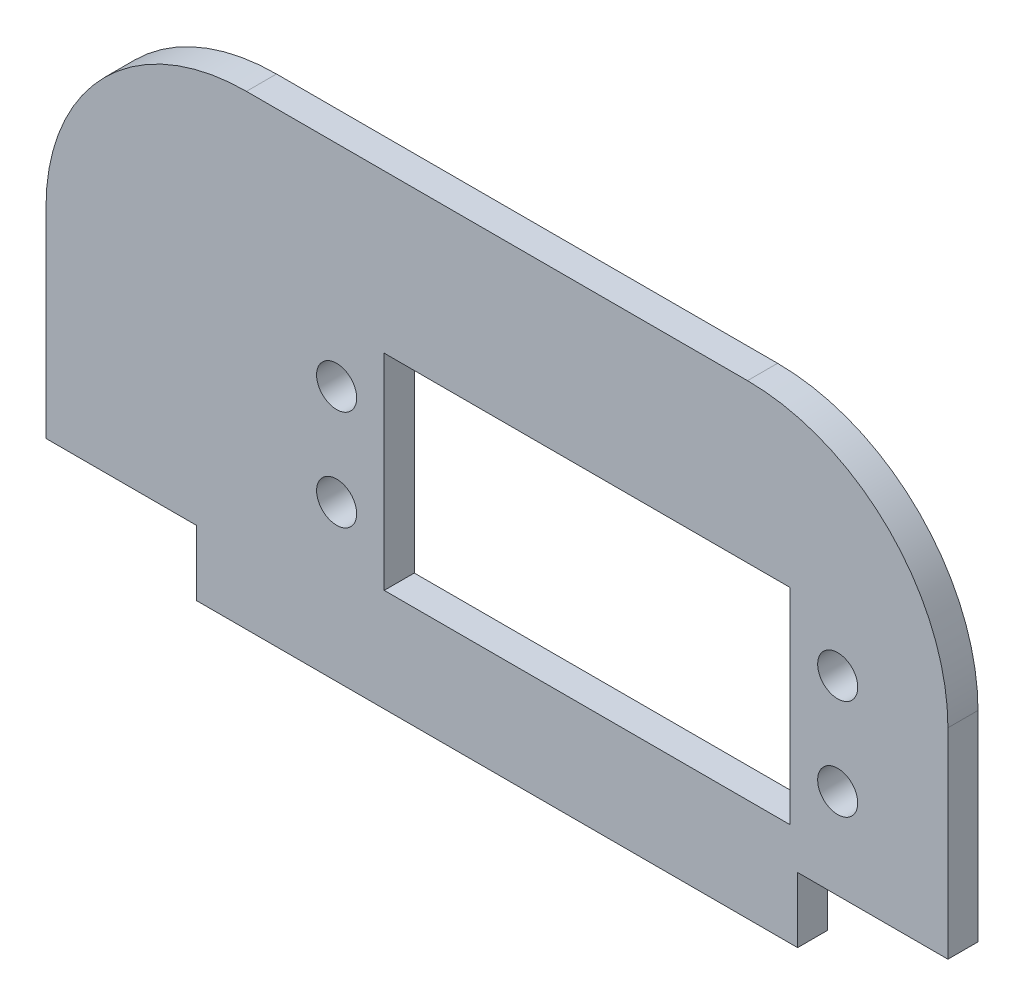
ISO-10303-21;
HEADER;
FILE_DESCRIPTION(('STEP AP214'),'2;1');
FILE_NAME('part.step','',(''),(''),'','','');
FILE_SCHEMA(('AUTOMOTIVE_DESIGN { 1 0 10303 214 1 1 1 1 }'));
ENDSEC;
DATA;
#1=APPLICATION_CONTEXT('core data for automotive mechanical design processes');
#2=APPLICATION_PROTOCOL_DEFINITION('international standard','automotive_design',2000,#1);
#3=PRODUCT_CONTEXT('',#1,'mechanical');
#4=PRODUCT('Part','Part','',(#3));
#5=PRODUCT_RELATED_PRODUCT_CATEGORY('part','',(#4));
#6=PRODUCT_DEFINITION_FORMATION('','',#4);
#7=PRODUCT_DEFINITION_CONTEXT('part definition',#1,'design');
#8=PRODUCT_DEFINITION('design','',#6,#7);
#9=PRODUCT_DEFINITION_SHAPE('','',#8);
#10=(LENGTH_UNIT() NAMED_UNIT(*) SI_UNIT(.MILLI.,.METRE.));
#11=(NAMED_UNIT(*) PLANE_ANGLE_UNIT() SI_UNIT($,.RADIAN.));
#12=(NAMED_UNIT(*) SI_UNIT($,.STERADIAN.) SOLID_ANGLE_UNIT());
#13=UNCERTAINTY_MEASURE_WITH_UNIT(LENGTH_MEASURE(1.E-05),#10,'distance_accuracy_value','');
#14=(GEOMETRIC_REPRESENTATION_CONTEXT(3) GLOBAL_UNCERTAINTY_ASSIGNED_CONTEXT((#13)) GLOBAL_UNIT_ASSIGNED_CONTEXT((#10,
#11,#12)) REPRESENTATION_CONTEXT('',''));
#15=CARTESIAN_POINT('',(0.,0.,0.));
#16=DIRECTION('',(0.,0.,1.));
#17=DIRECTION('',(1.,0.,0.));
#18=AXIS2_PLACEMENT_3D('',#15,#16,#17);
#19=CARTESIAN_POINT('',(45.,-20.,3.));
#20=DIRECTION('',(-1.,0.,0.));
#21=DIRECTION('',(0.,-1.,0.));
#22=AXIS2_PLACEMENT_3D('',#19,#20,#21);
#23=PLANE('',#22);
#24=DIRECTION('',(0.,1.,0.));
#25=VECTOR('',#24,1.);
#26=CARTESIAN_POINT('',(45.,-20.,0.));
#27=LINE('',#26,#25);
#28=CARTESIAN_POINT('',(45.,-20.,0.));
#29=VERTEX_POINT('',#28);
#30=CARTESIAN_POINT('',(45.,0.,0.));
#31=VERTEX_POINT('',#30);
#32=EDGE_CURVE('E159',#29,#31,#27,.T.);
#33=ORIENTED_EDGE('',*,*,#32,.T.);
#34=DIRECTION('',(0.,0.,-1.));
#35=VECTOR('',#34,1.);
#36=CARTESIAN_POINT('',(45.,0.,3.));
#37=LINE('',#36,#35);
#38=CARTESIAN_POINT('',(45.,0.,3.));
#39=VERTEX_POINT('',#38);
#40=EDGE_CURVE('E66',#31,#39,#37,.F.);
#41=ORIENTED_EDGE('',*,*,#40,.T.);
#42=DIRECTION('',(0.,1.,0.));
#43=VECTOR('',#42,1.);
#44=CARTESIAN_POINT('',(45.,-20.,3.));
#45=LINE('',#44,#43);
#46=CARTESIAN_POINT('',(45.,-20.,3.));
#47=VERTEX_POINT('',#46);
#48=EDGE_CURVE('E201',#47,#39,#45,.T.);
#49=ORIENTED_EDGE('',*,*,#48,.F.);
#50=DIRECTION('',(0.,0.,-1.));
#51=VECTOR('',#50,1.);
#52=CARTESIAN_POINT('',(45.,-20.,3.));
#53=LINE('',#52,#51);
#54=EDGE_CURVE('E226',#47,#29,#53,.T.);
#55=ORIENTED_EDGE('',*,*,#54,.T.);
#56=EDGE_LOOP('',(#33,#41,#49,#55));
#57=FACE_BOUND('',#56,.T.);
#58=ADVANCED_FACE('F42',(#57),#23,.F.);
#59=CARTESIAN_POINT('',(-45.,20.,3.));
#60=DIRECTION('',(0.,-1.,0.));
#61=DIRECTION('',(0.,0.,-1.));
#62=AXIS2_PLACEMENT_3D('',#59,#60,#61);
#63=PLANE('',#62);
#64=DIRECTION('',(-1.,0.,0.));
#65=VECTOR('',#64,1.);
#66=CARTESIAN_POINT('',(-45.,20.,3.));
#67=LINE('',#66,#65);
#68=CARTESIAN_POINT('',(25.,20.,3.));
#69=VERTEX_POINT('',#68);
#70=CARTESIAN_POINT('',(-25.,20.,3.));
#71=VERTEX_POINT('',#70);
#72=EDGE_CURVE('E204',#69,#71,#67,.T.);
#73=ORIENTED_EDGE('',*,*,#72,.F.);
#74=DIRECTION('',(0.,0.,-1.));
#75=VECTOR('',#74,1.);
#76=CARTESIAN_POINT('',(25.,20.,3.));
#77=LINE('',#76,#75);
#78=CARTESIAN_POINT('',(25.,20.,0.));
#79=VERTEX_POINT('',#78);
#80=EDGE_CURVE('E276',#69,#79,#77,.T.);
#81=ORIENTED_EDGE('',*,*,#80,.T.);
#82=DIRECTION('',(-1.,0.,0.));
#83=VECTOR('',#82,1.);
#84=CARTESIAN_POINT('',(-45.,20.,0.));
#85=LINE('',#84,#83);
#86=CARTESIAN_POINT('',(-25.,20.,0.));
#87=VERTEX_POINT('',#86);
#88=EDGE_CURVE('E229',#79,#87,#85,.T.);
#89=ORIENTED_EDGE('',*,*,#88,.T.);
#90=DIRECTION('',(0.,0.,-1.));
#91=VECTOR('',#90,1.);
#92=CARTESIAN_POINT('',(-25.,20.,3.));
#93=LINE('',#92,#91);
#94=EDGE_CURVE('E273',#87,#71,#93,.F.);
#95=ORIENTED_EDGE('',*,*,#94,.T.);
#96=EDGE_LOOP('',(#73,#81,#89,#95));
#97=FACE_BOUND('',#96,.T.);
#98=ADVANCED_FACE('F296',(#97),#63,.F.);
#99=CARTESIAN_POINT('',(-45.,-20.,3.));
#100=DIRECTION('',(1.,0.,0.));
#101=DIRECTION('',(0.,0.,-1.));
#102=AXIS2_PLACEMENT_3D('',#99,#100,#101);
#103=PLANE('',#102);
#104=DIRECTION('',(0.,-1.,0.));
#105=VECTOR('',#104,1.);
#106=CARTESIAN_POINT('',(-45.,-20.,3.));
#107=LINE('',#106,#105);
#108=CARTESIAN_POINT('',(-45.,0.,3.));
#109=VERTEX_POINT('',#108);
#110=CARTESIAN_POINT('',(-45.,-20.,3.));
#111=VERTEX_POINT('',#110);
#112=EDGE_CURVE('E208',#109,#111,#107,.T.);
#113=ORIENTED_EDGE('',*,*,#112,.F.);
#114=DIRECTION('',(0.,0.,-1.));
#115=VECTOR('',#114,1.);
#116=CARTESIAN_POINT('',(-45.,0.,3.));
#117=LINE('',#116,#115);
#118=CARTESIAN_POINT('',(-45.,0.,0.));
#119=VERTEX_POINT('',#118);
#120=EDGE_CURVE('E11',#109,#119,#117,.T.);
#121=ORIENTED_EDGE('',*,*,#120,.T.);
#122=DIRECTION('',(0.,-1.,0.));
#123=VECTOR('',#122,1.);
#124=CARTESIAN_POINT('',(-45.,-20.,0.));
#125=LINE('',#124,#123);
#126=CARTESIAN_POINT('',(-45.,-20.,0.));
#127=VERTEX_POINT('',#126);
#128=EDGE_CURVE('E233',#119,#127,#125,.T.);
#129=ORIENTED_EDGE('',*,*,#128,.T.);
#130=DIRECTION('',(0.,0.,-1.));
#131=VECTOR('',#130,1.);
#132=CARTESIAN_POINT('',(-45.,-20.,3.));
#133=LINE('',#132,#131);
#134=EDGE_CURVE('E269',#111,#127,#133,.T.);
#135=ORIENTED_EDGE('',*,*,#134,.F.);
#136=EDGE_LOOP('',(#113,#121,#129,#135));
#137=FACE_BOUND('',#136,.T.);
#138=ADVANCED_FACE('F329',(#137),#103,.F.);
#139=CARTESIAN_POINT('',(-45.,-20.,3.));
#140=DIRECTION('',(0.,1.,0.));
#141=DIRECTION('',(0.,0.,1.));
#142=AXIS2_PLACEMENT_3D('',#139,#140,#141);
#143=PLANE('',#142);
#144=DIRECTION('',(1.,0.,0.));
#145=VECTOR('',#144,1.);
#146=CARTESIAN_POINT('',(-45.,-20.,0.));
#147=LINE('',#146,#145);
#148=CARTESIAN_POINT('',(-30.,-20.,0.));
#149=VERTEX_POINT('',#148);
#150=EDGE_CURVE('E236',#127,#149,#147,.T.);
#151=ORIENTED_EDGE('',*,*,#150,.T.);
#152=DIRECTION('',(0.,0.,-1.));
#153=VECTOR('',#152,1.);
#154=CARTESIAN_POINT('',(-30.,-20.,3.));
#155=LINE('',#154,#153);
#156=CARTESIAN_POINT('',(-30.,-20.,3.));
#157=VERTEX_POINT('',#156);
#158=EDGE_CURVE('E265',#157,#149,#155,.T.);
#159=ORIENTED_EDGE('',*,*,#158,.F.);
#160=DIRECTION('',(1.,0.,0.));
#161=VECTOR('',#160,1.);
#162=CARTESIAN_POINT('',(-45.,-20.,3.));
#163=LINE('',#162,#161);
#164=EDGE_CURVE('E211',#111,#157,#163,.T.);
#165=ORIENTED_EDGE('',*,*,#164,.F.);
#166=ORIENTED_EDGE('',*,*,#134,.T.);
#167=EDGE_LOOP('',(#151,#159,#165,#166));
#168=FACE_BOUND('',#167,.T.);
#169=ADVANCED_FACE('F325',(#168),#143,.F.);
#170=CARTESIAN_POINT('',(-30.,-20.,3.));
#171=DIRECTION('',(1.,0.,0.));
#172=DIRECTION('',(0.,0.,-1.));
#173=AXIS2_PLACEMENT_3D('',#170,#171,#172);
#174=PLANE('',#173);
#175=DIRECTION('',(0.,-1.,0.));
#176=VECTOR('',#175,1.);
#177=CARTESIAN_POINT('',(-30.,-20.,0.));
#178=LINE('',#177,#176);
#179=CARTESIAN_POINT('',(-30.,-26.5,0.));
#180=VERTEX_POINT('',#179);
#181=EDGE_CURVE('E239',#149,#180,#178,.T.);
#182=ORIENTED_EDGE('',*,*,#181,.T.);
#183=DIRECTION('',(0.,0.,-1.));
#184=VECTOR('',#183,1.);
#185=CARTESIAN_POINT('',(-30.,-26.5,3.));
#186=LINE('',#185,#184);
#187=CARTESIAN_POINT('',(-30.,-26.5,3.));
#188=VERTEX_POINT('',#187);
#189=EDGE_CURVE('E261',#188,#180,#186,.T.);
#190=ORIENTED_EDGE('',*,*,#189,.F.);
#191=DIRECTION('',(0.,-1.,0.));
#192=VECTOR('',#191,1.);
#193=CARTESIAN_POINT('',(-30.,-20.,3.));
#194=LINE('',#193,#192);
#195=EDGE_CURVE('E214',#157,#188,#194,.T.);
#196=ORIENTED_EDGE('',*,*,#195,.F.);
#197=ORIENTED_EDGE('',*,*,#158,.T.);
#198=EDGE_LOOP('',(#182,#190,#196,#197));
#199=FACE_BOUND('',#198,.T.);
#200=ADVANCED_FACE('F320',(#199),#174,.F.);
#201=CARTESIAN_POINT('',(-30.,-26.5,3.));
#202=DIRECTION('',(0.,1.,0.));
#203=DIRECTION('',(0.,0.,1.));
#204=AXIS2_PLACEMENT_3D('',#201,#202,#203);
#205=PLANE('',#204);
#206=DIRECTION('',(1.,0.,0.));
#207=VECTOR('',#206,1.);
#208=CARTESIAN_POINT('',(-30.,-26.5,0.));
#209=LINE('',#208,#207);
#210=CARTESIAN_POINT('',(30.,-26.5,0.));
#211=VERTEX_POINT('',#210);
#212=EDGE_CURVE('E242',#180,#211,#209,.T.);
#213=ORIENTED_EDGE('',*,*,#212,.T.);
#214=DIRECTION('',(0.,0.,-1.));
#215=VECTOR('',#214,1.);
#216=CARTESIAN_POINT('',(30.,-26.5,3.));
#217=LINE('',#216,#215);
#218=CARTESIAN_POINT('',(30.,-26.5,3.));
#219=VERTEX_POINT('',#218);
#220=EDGE_CURVE('E257',#219,#211,#217,.T.);
#221=ORIENTED_EDGE('',*,*,#220,.F.);
#222=DIRECTION('',(1.,0.,0.));
#223=VECTOR('',#222,1.);
#224=CARTESIAN_POINT('',(-30.,-26.5,3.));
#225=LINE('',#224,#223);
#226=EDGE_CURVE('E217',#188,#219,#225,.T.);
#227=ORIENTED_EDGE('',*,*,#226,.F.);
#228=ORIENTED_EDGE('',*,*,#189,.T.);
#229=EDGE_LOOP('',(#213,#221,#227,#228));
#230=FACE_BOUND('',#229,.T.);
#231=ADVANCED_FACE('F316',(#230),#205,.F.);
#232=CARTESIAN_POINT('',(30.,-20.,3.));
#233=DIRECTION('',(-1.,0.,0.));
#234=DIRECTION('',(0.,-1.,0.));
#235=AXIS2_PLACEMENT_3D('',#232,#233,#234);
#236=PLANE('',#235);
#237=DIRECTION('',(0.,1.,0.));
#238=VECTOR('',#237,1.);
#239=CARTESIAN_POINT('',(30.,-20.,0.));
#240=LINE('',#239,#238);
#241=CARTESIAN_POINT('',(30.,-20.,0.));
#242=VERTEX_POINT('',#241);
#243=EDGE_CURVE('E245',#211,#242,#240,.T.);
#244=ORIENTED_EDGE('',*,*,#243,.T.);
#245=DIRECTION('',(0.,0.,-1.));
#246=VECTOR('',#245,1.);
#247=CARTESIAN_POINT('',(30.,-20.,3.));
#248=LINE('',#247,#246);
#249=CARTESIAN_POINT('',(30.,-20.,3.));
#250=VERTEX_POINT('',#249);
#251=EDGE_CURVE('E253',#250,#242,#248,.T.);
#252=ORIENTED_EDGE('',*,*,#251,.F.);
#253=DIRECTION('',(0.,1.,0.));
#254=VECTOR('',#253,1.);
#255=CARTESIAN_POINT('',(30.,-20.,3.));
#256=LINE('',#255,#254);
#257=EDGE_CURVE('E220',#219,#250,#256,.T.);
#258=ORIENTED_EDGE('',*,*,#257,.F.);
#259=ORIENTED_EDGE('',*,*,#220,.T.);
#260=EDGE_LOOP('',(#244,#252,#258,#259));
#261=FACE_BOUND('',#260,.T.);
#262=ADVANCED_FACE('F311',(#261),#236,.F.);
#263=CARTESIAN_POINT('',(30.,-20.,3.));
#264=DIRECTION('',(0.,1.,0.));
#265=DIRECTION('',(0.,0.,1.));
#266=AXIS2_PLACEMENT_3D('',#263,#264,#265);
#267=PLANE('',#266);
#268=DIRECTION('',(1.,0.,0.));
#269=VECTOR('',#268,1.);
#270=CARTESIAN_POINT('',(30.,-20.,0.));
#271=LINE('',#270,#269);
#272=EDGE_CURVE('E205',#242,#29,#271,.T.);
#273=ORIENTED_EDGE('',*,*,#272,.T.);
#274=ORIENTED_EDGE('',*,*,#54,.F.);
#275=DIRECTION('',(1.,0.,0.));
#276=VECTOR('',#275,1.);
#277=CARTESIAN_POINT('',(30.,-20.,3.));
#278=LINE('',#277,#276);
#279=EDGE_CURVE('E223',#250,#47,#278,.T.);
#280=ORIENTED_EDGE('',*,*,#279,.F.);
#281=ORIENTED_EDGE('',*,*,#251,.T.);
#282=EDGE_LOOP('',(#273,#274,#280,#281));
#283=FACE_BOUND('',#282,.T.);
#284=ADVANCED_FACE('F305',(#283),#267,.F.);
#285=CARTESIAN_POINT('',(0.,0.,3.));
#286=DIRECTION('',(0.,0.,-1.));
#287=DIRECTION('',(-1.,0.,0.));
#288=AXIS2_PLACEMENT_3D('',#285,#286,#287);
#289=PLANE('',#288);
#290=CARTESIAN_POINT('',(-16.,-1.,3.));
#291=DIRECTION('',(0.,0.,1.));
#292=DIRECTION('',(-1.,0.,0.));
#293=AXIS2_PLACEMENT_3D('',#290,#291,#292);
#294=CIRCLE('',#293,2.);
#295=CARTESIAN_POINT('',(-18.,-1.,3.));
#296=VERTEX_POINT('',#295);
#297=EDGE_CURVE('E409',#296,#296,#294,.T.);
#298=ORIENTED_EDGE('',*,*,#297,.F.);
#299=EDGE_LOOP('',(#298));
#300=FACE_BOUND('',#299,.T.);
#301=CARTESIAN_POINT('',(34.,-11.,3.));
#302=DIRECTION('',(0.,0.,1.));
#303=DIRECTION('',(-1.,0.,0.));
#304=AXIS2_PLACEMENT_3D('',#301,#302,#303);
#305=CIRCLE('',#304,2.);
#306=CARTESIAN_POINT('',(32.,-11.,3.));
#307=VERTEX_POINT('',#306);
#308=EDGE_CURVE('E401',#307,#307,#305,.T.);
#309=ORIENTED_EDGE('',*,*,#308,.F.);
#310=EDGE_LOOP('',(#309));
#311=FACE_BOUND('',#310,.T.);
#312=CARTESIAN_POINT('',(-16.,-11.,3.));
#313=DIRECTION('',(0.,0.,1.));
#314=DIRECTION('',(1.,0.,0.));
#315=AXIS2_PLACEMENT_3D('',#312,#313,#314);
#316=CIRCLE('',#315,2.);
#317=CARTESIAN_POINT('',(-14.,-11.,3.));
#318=VERTEX_POINT('',#317);
#319=EDGE_CURVE('E396',#318,#318,#316,.T.);
#320=ORIENTED_EDGE('',*,*,#319,.F.);
#321=EDGE_LOOP('',(#320));
#322=FACE_BOUND('',#321,.T.);
#323=CARTESIAN_POINT('',(34.,-1.,3.));
#324=DIRECTION('',(0.,0.,1.));
#325=DIRECTION('',(1.,0.,0.));
#326=AXIS2_PLACEMENT_3D('',#323,#324,#325);
#327=CIRCLE('',#326,2.);
#328=CARTESIAN_POINT('',(36.,-1.,3.));
#329=VERTEX_POINT('',#328);
#330=EDGE_CURVE('E420',#329,#329,#327,.T.);
#331=ORIENTED_EDGE('',*,*,#330,.F.);
#332=EDGE_LOOP('',(#331));
#333=FACE_BOUND('',#332,.T.);
#334=DIRECTION('',(-1.,0.,0.));
#335=VECTOR('',#334,1.);
#336=CARTESIAN_POINT('',(-11.25,4.25,3.));
#337=LINE('',#336,#335);
#338=CARTESIAN_POINT('',(29.25,4.25,3.));
#339=VERTEX_POINT('',#338);
#340=CARTESIAN_POINT('',(-11.25,4.25,3.));
#341=VERTEX_POINT('',#340);
#342=EDGE_CURVE('E179',#339,#341,#337,.T.);
#343=ORIENTED_EDGE('',*,*,#342,.F.);
#344=DIRECTION('',(0.,1.,0.));
#345=VECTOR('',#344,1.);
#346=CARTESIAN_POINT('',(29.25,4.25,3.));
#347=LINE('',#346,#345);
#348=CARTESIAN_POINT('',(29.25,-16.25,3.));
#349=VERTEX_POINT('',#348);
#350=EDGE_CURVE('E167',#349,#339,#347,.T.);
#351=ORIENTED_EDGE('',*,*,#350,.F.);
#352=DIRECTION('',(1.,0.,0.));
#353=VECTOR('',#352,1.);
#354=CARTESIAN_POINT('',(-11.25,-16.25,3.));
#355=LINE('',#354,#353);
#356=CARTESIAN_POINT('',(-11.25,-16.25,3.));
#357=VERTEX_POINT('',#356);
#358=EDGE_CURVE('E169',#357,#349,#355,.T.);
#359=ORIENTED_EDGE('',*,*,#358,.F.);
#360=DIRECTION('',(0.,-1.,0.));
#361=VECTOR('',#360,1.);
#362=CARTESIAN_POINT('',(-11.25,4.25,3.));
#363=LINE('',#362,#361);
#364=EDGE_CURVE('E187',#341,#357,#363,.T.);
#365=ORIENTED_EDGE('',*,*,#364,.F.);
#366=EDGE_LOOP('',(#343,#351,#359,#365));
#367=FACE_BOUND('',#366,.T.);
#368=ORIENTED_EDGE('',*,*,#48,.T.);
#369=CARTESIAN_POINT('',(25.,0.,3.));
#370=DIRECTION('',(0.,0.,-1.));
#371=DIRECTION('',(-1.,0.,0.));
#372=AXIS2_PLACEMENT_3D('',#369,#370,#371);
#373=CIRCLE('',#372,20.);
#374=EDGE_CURVE('E51',#39,#69,#373,.F.);
#375=ORIENTED_EDGE('',*,*,#374,.T.);
#376=ORIENTED_EDGE('',*,*,#72,.T.);
#377=CARTESIAN_POINT('',(-25.,0.,3.));
#378=DIRECTION('',(0.,0.,-1.));
#379=DIRECTION('',(-1.,0.,0.));
#380=AXIS2_PLACEMENT_3D('',#377,#378,#379);
#381=CIRCLE('',#380,20.);
#382=EDGE_CURVE('E58',#71,#109,#381,.F.);
#383=ORIENTED_EDGE('',*,*,#382,.T.);
#384=ORIENTED_EDGE('',*,*,#112,.T.);
#385=ORIENTED_EDGE('',*,*,#164,.T.);
#386=ORIENTED_EDGE('',*,*,#195,.T.);
#387=ORIENTED_EDGE('',*,*,#226,.T.);
#388=ORIENTED_EDGE('',*,*,#257,.T.);
#389=ORIENTED_EDGE('',*,*,#279,.T.);
#390=EDGE_LOOP('',(#368,#375,#376,#383,#384,#385,#386,#387,#388,#389));
#391=FACE_BOUND('',#390,.T.);
#392=ADVANCED_FACE('F292',(#300,#311,#322,#333,#367,#391),#289,.F.);
#393=CARTESIAN_POINT('',(0.,0.,0.));
#394=DIRECTION('',(0.,0.,-1.));
#395=DIRECTION('',(-1.,0.,0.));
#396=AXIS2_PLACEMENT_3D('',#393,#394,#395);
#397=PLANE('',#396);
#398=CARTESIAN_POINT('',(-16.,-1.,0.));
#399=DIRECTION('',(0.,0.,-1.));
#400=DIRECTION('',(-1.,0.,0.));
#401=AXIS2_PLACEMENT_3D('',#398,#399,#400);
#402=CIRCLE('',#401,2.);
#403=CARTESIAN_POINT('',(-18.,-1.,0.));
#404=VERTEX_POINT('',#403);
#405=EDGE_CURVE('E404',#404,#404,#402,.F.);
#406=ORIENTED_EDGE('',*,*,#405,.T.);
#407=EDGE_LOOP('',(#406));
#408=FACE_BOUND('',#407,.T.);
#409=CARTESIAN_POINT('',(34.,-11.,0.));
#410=DIRECTION('',(0.,0.,-1.));
#411=DIRECTION('',(-1.,0.,0.));
#412=AXIS2_PLACEMENT_3D('',#409,#410,#411);
#413=CIRCLE('',#412,2.);
#414=CARTESIAN_POINT('',(32.,-11.,0.));
#415=VERTEX_POINT('',#414);
#416=EDGE_CURVE('E413',#415,#415,#413,.F.);
#417=ORIENTED_EDGE('',*,*,#416,.T.);
#418=EDGE_LOOP('',(#417));
#419=FACE_BOUND('',#418,.T.);
#420=CARTESIAN_POINT('',(-16.,-11.,0.));
#421=DIRECTION('',(0.,0.,-1.));
#422=DIRECTION('',(-1.,0.,0.));
#423=AXIS2_PLACEMENT_3D('',#420,#421,#422);
#424=CIRCLE('',#423,2.);
#425=CARTESIAN_POINT('',(-18.,-11.,0.));
#426=VERTEX_POINT('',#425);
#427=EDGE_CURVE('E393',#426,#426,#424,.F.);
#428=ORIENTED_EDGE('',*,*,#427,.T.);
#429=EDGE_LOOP('',(#428));
#430=FACE_BOUND('',#429,.T.);
#431=CARTESIAN_POINT('',(34.,-1.,0.));
#432=DIRECTION('',(0.,0.,-1.));
#433=DIRECTION('',(-1.,0.,0.));
#434=AXIS2_PLACEMENT_3D('',#431,#432,#433);
#435=CIRCLE('',#434,2.);
#436=CARTESIAN_POINT('',(32.,-1.,0.));
#437=VERTEX_POINT('',#436);
#438=EDGE_CURVE('E408',#437,#437,#435,.F.);
#439=ORIENTED_EDGE('',*,*,#438,.T.);
#440=EDGE_LOOP('',(#439));
#441=FACE_BOUND('',#440,.T.);
#442=DIRECTION('',(0.,1.,0.));
#443=VECTOR('',#442,1.);
#444=CARTESIAN_POINT('',(29.25,4.25,0.));
#445=LINE('',#444,#443);
#446=CARTESIAN_POINT('',(29.25,-16.25,0.));
#447=VERTEX_POINT('',#446);
#448=CARTESIAN_POINT('',(29.25,4.25,0.));
#449=VERTEX_POINT('',#448);
#450=EDGE_CURVE('E164',#447,#449,#445,.T.);
#451=ORIENTED_EDGE('',*,*,#450,.T.);
#452=DIRECTION('',(-1.,0.,0.));
#453=VECTOR('',#452,1.);
#454=CARTESIAN_POINT('',(-11.25,4.25,0.));
#455=LINE('',#454,#453);
#456=CARTESIAN_POINT('',(-11.25,4.25,0.));
#457=VERTEX_POINT('',#456);
#458=EDGE_CURVE('E147',#449,#457,#455,.T.);
#459=ORIENTED_EDGE('',*,*,#458,.T.);
#460=DIRECTION('',(0.,-1.,0.));
#461=VECTOR('',#460,1.);
#462=CARTESIAN_POINT('',(-11.25,4.25,0.));
#463=LINE('',#462,#461);
#464=CARTESIAN_POINT('',(-11.25,-16.25,0.));
#465=VERTEX_POINT('',#464);
#466=EDGE_CURVE('E181',#457,#465,#463,.T.);
#467=ORIENTED_EDGE('',*,*,#466,.T.);
#468=DIRECTION('',(1.,0.,0.));
#469=VECTOR('',#468,1.);
#470=CARTESIAN_POINT('',(-11.25,-16.25,0.));
#471=LINE('',#470,#469);
#472=EDGE_CURVE('E174',#465,#447,#471,.T.);
#473=ORIENTED_EDGE('',*,*,#472,.T.);
#474=EDGE_LOOP('',(#451,#459,#467,#473));
#475=FACE_BOUND('',#474,.T.);
#476=ORIENTED_EDGE('',*,*,#88,.F.);
#477=CARTESIAN_POINT('',(25.,0.,0.));
#478=DIRECTION('',(0.,0.,-1.));
#479=DIRECTION('',(-1.,0.,0.));
#480=AXIS2_PLACEMENT_3D('',#477,#478,#479);
#481=CIRCLE('',#480,20.);
#482=EDGE_CURVE('E283',#79,#31,#481,.T.);
#483=ORIENTED_EDGE('',*,*,#482,.T.);
#484=ORIENTED_EDGE('',*,*,#32,.F.);
#485=ORIENTED_EDGE('',*,*,#272,.F.);
#486=ORIENTED_EDGE('',*,*,#243,.F.);
#487=ORIENTED_EDGE('',*,*,#212,.F.);
#488=ORIENTED_EDGE('',*,*,#181,.F.);
#489=ORIENTED_EDGE('',*,*,#150,.F.);
#490=ORIENTED_EDGE('',*,*,#128,.F.);
#491=CARTESIAN_POINT('',(-25.,0.,0.));
#492=DIRECTION('',(0.,0.,-1.));
#493=DIRECTION('',(-1.,0.,0.));
#494=AXIS2_PLACEMENT_3D('',#491,#492,#493);
#495=CIRCLE('',#494,20.);
#496=EDGE_CURVE('E280',#119,#87,#495,.T.);
#497=ORIENTED_EDGE('',*,*,#496,.T.);
#498=EDGE_LOOP('',(#476,#483,#484,#485,#486,#487,#488,#489,#490,#497));
#499=FACE_BOUND('',#498,.T.);
#500=ADVANCED_FACE('F172',(#408,#419,#430,#441,#475,#499),#397,.T.);
#501=CARTESIAN_POINT('',(29.25,4.25,-0.00100000000000013));
#502=DIRECTION('',(1.,0.,0.));
#503=DIRECTION('',(0.,1.,0.));
#504=AXIS2_PLACEMENT_3D('',#501,#502,#503);
#505=PLANE('',#504);
#506=DIRECTION('',(0.,0.,1.));
#507=VECTOR('',#506,1.);
#508=CARTESIAN_POINT('',(29.25,-16.25,-0.00100000000000013));
#509=LINE('',#508,#507);
#510=EDGE_CURVE('E160',#447,#349,#509,.T.);
#511=ORIENTED_EDGE('',*,*,#510,.T.);
#512=ORIENTED_EDGE('',*,*,#350,.T.);
#513=DIRECTION('',(0.,0.,1.));
#514=VECTOR('',#513,1.);
#515=CARTESIAN_POINT('',(29.25,4.25,-0.00100000000000013));
#516=LINE('',#515,#514);
#517=EDGE_CURVE('E151',#449,#339,#516,.T.);
#518=ORIENTED_EDGE('',*,*,#517,.F.);
#519=ORIENTED_EDGE('',*,*,#450,.F.);
#520=EDGE_LOOP('',(#511,#512,#518,#519));
#521=FACE_BOUND('',#520,.T.);
#522=ADVANCED_FACE('F163',(#521),#505,.F.);
#523=CARTESIAN_POINT('',(-11.25,-16.25,-0.00100000000000013));
#524=DIRECTION('',(0.,-1.,0.));
#525=DIRECTION('',(0.,0.,-1.));
#526=AXIS2_PLACEMENT_3D('',#523,#524,#525);
#527=PLANE('',#526);
#528=DIRECTION('',(0.,0.,1.));
#529=VECTOR('',#528,1.);
#530=CARTESIAN_POINT('',(-11.25,-16.25,-0.00100000000000013));
#531=LINE('',#530,#529);
#532=EDGE_CURVE('E196',#465,#357,#531,.T.);
#533=ORIENTED_EDGE('',*,*,#532,.T.);
#534=ORIENTED_EDGE('',*,*,#358,.T.);
#535=ORIENTED_EDGE('',*,*,#510,.F.);
#536=ORIENTED_EDGE('',*,*,#472,.F.);
#537=EDGE_LOOP('',(#533,#534,#535,#536));
#538=FACE_BOUND('',#537,.T.);
#539=ADVANCED_FACE('F368',(#538),#527,.F.);
#540=CARTESIAN_POINT('',(-11.25,4.25,-0.00100000000000013));
#541=DIRECTION('',(-1.,0.,0.));
#542=DIRECTION('',(0.,-1.,0.));
#543=AXIS2_PLACEMENT_3D('',#540,#541,#542);
#544=PLANE('',#543);
#545=DIRECTION('',(0.,0.,1.));
#546=VECTOR('',#545,1.);
#547=CARTESIAN_POINT('',(-11.25,4.25,-0.00100000000000013));
#548=LINE('',#547,#546);
#549=EDGE_CURVE('E153',#457,#341,#548,.T.);
#550=ORIENTED_EDGE('',*,*,#549,.T.);
#551=ORIENTED_EDGE('',*,*,#364,.T.);
#552=ORIENTED_EDGE('',*,*,#532,.F.);
#553=ORIENTED_EDGE('',*,*,#466,.F.);
#554=EDGE_LOOP('',(#550,#551,#552,#553));
#555=FACE_BOUND('',#554,.T.);
#556=ADVANCED_FACE('F371',(#555),#544,.F.);
#557=CARTESIAN_POINT('',(-11.25,4.25,-0.00100000000000013));
#558=DIRECTION('',(0.,1.,0.));
#559=DIRECTION('',(0.,0.,1.));
#560=AXIS2_PLACEMENT_3D('',#557,#558,#559);
#561=PLANE('',#560);
#562=ORIENTED_EDGE('',*,*,#517,.T.);
#563=ORIENTED_EDGE('',*,*,#342,.T.);
#564=ORIENTED_EDGE('',*,*,#549,.F.);
#565=ORIENTED_EDGE('',*,*,#458,.F.);
#566=EDGE_LOOP('',(#562,#563,#564,#565));
#567=FACE_BOUND('',#566,.T.);
#568=ADVANCED_FACE('F149',(#567),#561,.F.);
#569=CARTESIAN_POINT('',(25.,0.,3.));
#570=DIRECTION('',(0.,0.,-1.));
#571=DIRECTION('',(-1.,0.,0.));
#572=AXIS2_PLACEMENT_3D('',#569,#570,#571);
#573=CYLINDRICAL_SURFACE('',#572,20.);
#574=ORIENTED_EDGE('',*,*,#374,.F.);
#575=ORIENTED_EDGE('',*,*,#40,.F.);
#576=ORIENTED_EDGE('',*,*,#482,.F.);
#577=ORIENTED_EDGE('',*,*,#80,.F.);
#578=EDGE_LOOP('',(#574,#575,#576,#577));
#579=FACE_BOUND('',#578,.T.);
#580=ADVANCED_FACE('F299',(#579),#573,.T.);
#581=CARTESIAN_POINT('',(-25.,0.,3.));
#582=DIRECTION('',(0.,0.,-1.));
#583=DIRECTION('',(-1.,0.,0.));
#584=AXIS2_PLACEMENT_3D('',#581,#582,#583);
#585=CYLINDRICAL_SURFACE('',#584,20.);
#586=ORIENTED_EDGE('',*,*,#382,.F.);
#587=ORIENTED_EDGE('',*,*,#94,.F.);
#588=ORIENTED_EDGE('',*,*,#496,.F.);
#589=ORIENTED_EDGE('',*,*,#120,.F.);
#590=EDGE_LOOP('',(#586,#587,#588,#589));
#591=FACE_BOUND('',#590,.T.);
#592=ADVANCED_FACE('F44',(#591),#585,.T.);
#593=CARTESIAN_POINT('',(34.,-1.,-0.00100000000000013));
#594=DIRECTION('',(0.,0.,1.));
#595=DIRECTION('',(1.,0.,0.));
#596=AXIS2_PLACEMENT_3D('',#593,#594,#595);
#597=CYLINDRICAL_SURFACE('',#596,2.);
#598=ORIENTED_EDGE('',*,*,#438,.F.);
#599=EDGE_LOOP('',(#598));
#600=FACE_BOUND('',#599,.T.);
#601=ORIENTED_EDGE('',*,*,#330,.T.);
#602=EDGE_LOOP('',(#601));
#603=FACE_BOUND('',#602,.T.);
#604=ADVANCED_FACE('F333',(#600,#603),#597,.F.);
#605=CARTESIAN_POINT('',(-16.,-11.,-0.00100000000000013));
#606=DIRECTION('',(0.,0.,1.));
#607=DIRECTION('',(1.,0.,0.));
#608=AXIS2_PLACEMENT_3D('',#605,#606,#607);
#609=CYLINDRICAL_SURFACE('',#608,2.);
#610=ORIENTED_EDGE('',*,*,#427,.F.);
#611=EDGE_LOOP('',(#610));
#612=FACE_BOUND('',#611,.T.);
#613=ORIENTED_EDGE('',*,*,#319,.T.);
#614=EDGE_LOOP('',(#613));
#615=FACE_BOUND('',#614,.T.);
#616=ADVANCED_FACE('F338',(#612,#615),#609,.F.);
#617=CARTESIAN_POINT('',(34.,-11.,-0.00100000000000013));
#618=DIRECTION('',(0.,0.,1.));
#619=DIRECTION('',(1.,0.,0.));
#620=AXIS2_PLACEMENT_3D('',#617,#618,#619);
#621=CYLINDRICAL_SURFACE('',#620,2.);
#622=ORIENTED_EDGE('',*,*,#416,.F.);
#623=EDGE_LOOP('',(#622));
#624=FACE_BOUND('',#623,.T.);
#625=ORIENTED_EDGE('',*,*,#308,.T.);
#626=EDGE_LOOP('',(#625));
#627=FACE_BOUND('',#626,.T.);
#628=ADVANCED_FACE('F378',(#624,#627),#621,.F.);
#629=CARTESIAN_POINT('',(-16.,-1.,-0.00100000000000013));
#630=DIRECTION('',(0.,0.,1.));
#631=DIRECTION('',(1.,0.,0.));
#632=AXIS2_PLACEMENT_3D('',#629,#630,#631);
#633=CYLINDRICAL_SURFACE('',#632,2.);
#634=ORIENTED_EDGE('',*,*,#405,.F.);
#635=EDGE_LOOP('',(#634));
#636=FACE_BOUND('',#635,.T.);
#637=ORIENTED_EDGE('',*,*,#297,.T.);
#638=EDGE_LOOP('',(#637));
#639=FACE_BOUND('',#638,.T.);
#640=ADVANCED_FACE('F381',(#636,#639),#633,.F.);
#641=CLOSED_SHELL('',(#58,#98,#138,#169,#200,#231,#262,#284,#392,#500,#522,#539,#556,#568,#580,
#592,#604,#616,#628,#640));
#642=MANIFOLD_SOLID_BREP('B2',#641);
#643=ADVANCED_BREP_SHAPE_REPRESENTATION('',(#18,#642),#14);
#644=SHAPE_DEFINITION_REPRESENTATION(#9,#643);
ENDSEC;
END-ISO-10303-21;
